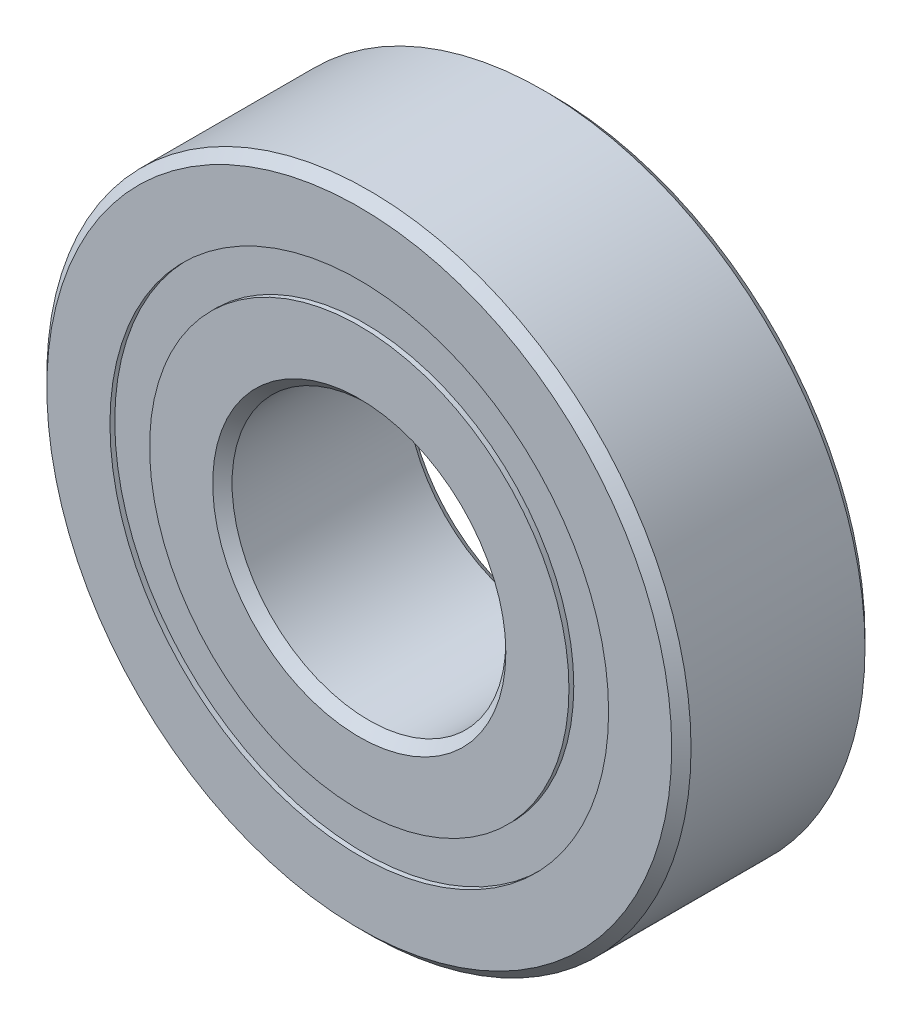
ISO-10303-21;
HEADER;
FILE_DESCRIPTION(('STEP AP214'),'2;1');
FILE_NAME('part.step','',(''),(''),'','','');
FILE_SCHEMA(('AUTOMOTIVE_DESIGN { 1 0 10303 214 1 1 1 1 }'));
ENDSEC;
DATA;
#1=APPLICATION_CONTEXT('core data for automotive mechanical design processes');
#2=APPLICATION_PROTOCOL_DEFINITION('international standard','automotive_design',2000,#1);
#3=PRODUCT_CONTEXT('',#1,'mechanical');
#4=PRODUCT('Part','Part','',(#3));
#5=PRODUCT_RELATED_PRODUCT_CATEGORY('part','',(#4));
#6=PRODUCT_DEFINITION_FORMATION('','',#4);
#7=PRODUCT_DEFINITION_CONTEXT('part definition',#1,'design');
#8=PRODUCT_DEFINITION('design','',#6,#7);
#9=PRODUCT_DEFINITION_SHAPE('','',#8);
#10=(LENGTH_UNIT() NAMED_UNIT(*) SI_UNIT(.MILLI.,.METRE.));
#11=(NAMED_UNIT(*) PLANE_ANGLE_UNIT() SI_UNIT($,.RADIAN.));
#12=(NAMED_UNIT(*) SI_UNIT($,.STERADIAN.) SOLID_ANGLE_UNIT());
#13=UNCERTAINTY_MEASURE_WITH_UNIT(LENGTH_MEASURE(1.E-05),#10,'distance_accuracy_value','');
#14=(GEOMETRIC_REPRESENTATION_CONTEXT(3) GLOBAL_UNCERTAINTY_ASSIGNED_CONTEXT((#13)) GLOBAL_UNIT_ASSIGNED_CONTEXT((#10,
#11,#12)) REPRESENTATION_CONTEXT('',''));
#15=CARTESIAN_POINT('',(0.,0.,0.));
#16=DIRECTION('',(0.,0.,1.));
#17=DIRECTION('',(1.,0.,0.));
#18=AXIS2_PLACEMENT_3D('',#15,#16,#17);
#19=CARTESIAN_POINT('',(0.,15.4807692307692,-5.70000000000001));
#20=DIRECTION('',(0.,0.,1.));
#21=DIRECTION('',(1.,0.,0.));
#22=AXIS2_PLACEMENT_3D('',#19,#20,#21);
#23=PLANE('',#22);
#24=CARTESIAN_POINT('',(0.,0.,-5.70000000000001));
#25=DIRECTION('',(0.,0.,1.));
#26=DIRECTION('',(1.,0.,0.));
#27=AXIS2_PLACEMENT_3D('',#24,#25,#26);
#28=CIRCLE('',#27,15.4807692307692);
#29=CARTESIAN_POINT('',(15.4807692307692,0.,-5.70000000000001));
#30=VERTEX_POINT('',#29);
#31=EDGE_CURVE('E70',#30,#30,#28,.T.);
#32=ORIENTED_EDGE('',*,*,#31,.F.);
#33=EDGE_LOOP('',(#32));
#34=FACE_BOUND('',#33,.T.);
#35=CARTESIAN_POINT('',(0.,0.,-5.70000000000001));
#36=DIRECTION('',(0.,0.,1.));
#37=DIRECTION('',(1.,0.,0.));
#38=AXIS2_PLACEMENT_3D('',#35,#36,#37);
#39=CIRCLE('',#38,13.0192307692308);
#40=CARTESIAN_POINT('',(13.0192307692308,0.,-5.70000000000001));
#41=VERTEX_POINT('',#40);
#42=EDGE_CURVE('E11',#41,#41,#39,.T.);
#43=ORIENTED_EDGE('',*,*,#42,.T.);
#44=EDGE_LOOP('',(#43));
#45=FACE_BOUND('',#44,.T.);
#46=ADVANCED_FACE('F56',(#34,#45),#23,.F.);
#47=CARTESIAN_POINT('',(0.,0.,6.));
#48=DIRECTION('',(0.,0.,1.));
#49=DIRECTION('',(1.,0.,0.));
#50=AXIS2_PLACEMENT_3D('',#47,#48,#49);
#51=CYLINDRICAL_SURFACE('',#50,13.0192307692308);
#52=ORIENTED_EDGE('',*,*,#42,.F.);
#53=EDGE_LOOP('',(#52));
#54=FACE_BOUND('',#53,.T.);
#55=CARTESIAN_POINT('',(0.,0.,-2.93698893605669));
#56=DIRECTION('',(0.,0.,1.));
#57=DIRECTION('',(1.,0.,0.));
#58=AXIS2_PLACEMENT_3D('',#55,#56,#57);
#59=CIRCLE('',#58,13.0192307692308);
#60=CARTESIAN_POINT('',(13.0192307692308,0.,-2.93698893605669));
#61=VERTEX_POINT('',#60);
#62=EDGE_CURVE('E62',#61,#61,#59,.T.);
#63=ORIENTED_EDGE('',*,*,#62,.T.);
#64=EDGE_LOOP('',(#63));
#65=FACE_BOUND('',#64,.T.);
#66=ADVANCED_FACE('F79',(#54,#65),#51,.F.);
#67=CARTESIAN_POINT('',(0.,15.4807692307692,-2.93698893605669));
#68=DIRECTION('',(0.,0.,-1.));
#69=DIRECTION('',(-1.,0.,0.));
#70=AXIS2_PLACEMENT_3D('',#67,#68,#69);
#71=PLANE('',#70);
#72=ORIENTED_EDGE('',*,*,#62,.F.);
#73=EDGE_LOOP('',(#72));
#74=FACE_BOUND('',#73,.T.);
#75=CARTESIAN_POINT('',(0.,0.,-2.93698893605669));
#76=DIRECTION('',(0.,0.,1.));
#77=DIRECTION('',(1.,0.,0.));
#78=AXIS2_PLACEMENT_3D('',#75,#76,#77);
#79=CIRCLE('',#78,15.4807692307692);
#80=CARTESIAN_POINT('',(15.4807692307692,0.,-2.93698893605669));
#81=VERTEX_POINT('',#80);
#82=EDGE_CURVE('E66',#81,#81,#79,.T.);
#83=ORIENTED_EDGE('',*,*,#82,.T.);
#84=EDGE_LOOP('',(#83));
#85=FACE_BOUND('',#84,.T.);
#86=ADVANCED_FACE('F83',(#74,#85),#71,.F.);
#87=CARTESIAN_POINT('',(0.,0.,6.));
#88=DIRECTION('',(0.,0.,1.));
#89=DIRECTION('',(1.,0.,0.));
#90=AXIS2_PLACEMENT_3D('',#87,#88,#89);
#91=CYLINDRICAL_SURFACE('',#90,15.4807692307692);
#92=ORIENTED_EDGE('',*,*,#82,.F.);
#93=EDGE_LOOP('',(#92));
#94=FACE_BOUND('',#93,.T.);
#95=ORIENTED_EDGE('',*,*,#31,.T.);
#96=EDGE_LOOP('',(#95));
#97=FACE_BOUND('',#96,.T.);
#98=ADVANCED_FACE('F76',(#94,#97),#91,.T.);
#99=CLOSED_SHELL('',(#46,#66,#86,#98));
#100=MANIFOLD_SOLID_BREP('B2',#99);
#101=CARTESIAN_POINT('',(0.,15.4807692307692,5.7));
#102=DIRECTION('',(0.,0.,-1.));
#103=DIRECTION('',(-1.,0.,0.));
#104=AXIS2_PLACEMENT_3D('',#101,#102,#103);
#105=PLANE('',#104);
#106=CARTESIAN_POINT('',(0.,0.,5.7));
#107=DIRECTION('',(0.,0.,1.));
#108=DIRECTION('',(1.,0.,0.));
#109=AXIS2_PLACEMENT_3D('',#106,#107,#108);
#110=CIRCLE('',#109,13.0192307692308);
#111=CARTESIAN_POINT('',(13.0192307692308,0.,5.7));
#112=VERTEX_POINT('',#111);
#113=EDGE_CURVE('E55',#112,#112,#110,.T.);
#114=ORIENTED_EDGE('',*,*,#113,.F.);
#115=EDGE_LOOP('',(#114));
#116=FACE_BOUND('',#115,.T.);
#117=CARTESIAN_POINT('',(0.,0.,5.7));
#118=DIRECTION('',(0.,0.,1.));
#119=DIRECTION('',(1.,0.,0.));
#120=AXIS2_PLACEMENT_3D('',#117,#118,#119);
#121=CIRCLE('',#120,15.4807692307692);
#122=CARTESIAN_POINT('',(15.4807692307692,0.,5.7));
#123=VERTEX_POINT('',#122);
#124=EDGE_CURVE('E130',#123,#123,#121,.T.);
#125=ORIENTED_EDGE('',*,*,#124,.T.);
#126=EDGE_LOOP('',(#125));
#127=FACE_BOUND('',#126,.T.);
#128=ADVANCED_FACE('F116',(#116,#127),#105,.F.);
#129=CARTESIAN_POINT('',(0.,0.,6.));
#130=DIRECTION('',(0.,0.,1.));
#131=DIRECTION('',(1.,0.,0.));
#132=AXIS2_PLACEMENT_3D('',#129,#130,#131);
#133=CYLINDRICAL_SURFACE('',#132,13.0192307692308);
#134=CARTESIAN_POINT('',(0.,0.,2.93698893605668));
#135=DIRECTION('',(0.,0.,1.));
#136=DIRECTION('',(1.,0.,0.));
#137=AXIS2_PLACEMENT_3D('',#134,#135,#136);
#138=CIRCLE('',#137,13.0192307692308);
#139=CARTESIAN_POINT('',(13.0192307692308,0.,2.93698893605668));
#140=VERTEX_POINT('',#139);
#141=EDGE_CURVE('E122',#140,#140,#138,.T.);
#142=ORIENTED_EDGE('',*,*,#141,.F.);
#143=EDGE_LOOP('',(#142));
#144=FACE_BOUND('',#143,.T.);
#145=ORIENTED_EDGE('',*,*,#113,.T.);
#146=EDGE_LOOP('',(#145));
#147=FACE_BOUND('',#146,.T.);
#148=ADVANCED_FACE('F145',(#144,#147),#133,.F.);
#149=CARTESIAN_POINT('',(0.,15.4807692307692,2.93698893605668));
#150=DIRECTION('',(0.,0.,1.));
#151=DIRECTION('',(1.,0.,0.));
#152=AXIS2_PLACEMENT_3D('',#149,#150,#151);
#153=PLANE('',#152);
#154=CARTESIAN_POINT('',(0.,0.,2.93698893605668));
#155=DIRECTION('',(0.,0.,1.));
#156=DIRECTION('',(1.,0.,0.));
#157=AXIS2_PLACEMENT_3D('',#154,#155,#156);
#158=CIRCLE('',#157,15.4807692307692);
#159=CARTESIAN_POINT('',(15.4807692307692,0.,2.93698893605668));
#160=VERTEX_POINT('',#159);
#161=EDGE_CURVE('E126',#160,#160,#158,.T.);
#162=ORIENTED_EDGE('',*,*,#161,.F.);
#163=EDGE_LOOP('',(#162));
#164=FACE_BOUND('',#163,.T.);
#165=ORIENTED_EDGE('',*,*,#141,.T.);
#166=EDGE_LOOP('',(#165));
#167=FACE_BOUND('',#166,.T.);
#168=ADVANCED_FACE('F140',(#164,#167),#153,.F.);
#169=CARTESIAN_POINT('',(0.,0.,6.));
#170=DIRECTION('',(0.,0.,1.));
#171=DIRECTION('',(1.,0.,0.));
#172=AXIS2_PLACEMENT_3D('',#169,#170,#171);
#173=CYLINDRICAL_SURFACE('',#172,15.4807692307692);
#174=ORIENTED_EDGE('',*,*,#124,.F.);
#175=EDGE_LOOP('',(#174));
#176=FACE_BOUND('',#175,.T.);
#177=ORIENTED_EDGE('',*,*,#161,.T.);
#178=EDGE_LOOP('',(#177));
#179=FACE_BOUND('',#178,.T.);
#180=ADVANCED_FACE('F137',(#176,#179),#173,.T.);
#181=CLOSED_SHELL('',(#128,#148,#168,#180));
#182=MANIFOLD_SOLID_BREP('B6',#181);
#183=CARTESIAN_POINT('',(-6.18284328242503,12.8388063676096,0.));
#184=DIRECTION('',(0.,0.,1.));
#185=DIRECTION('',(-0.433883739117546,0.900968867902425,0.));
#186=AXIS2_PLACEMENT_3D('',#183,#184,#185);
#187=SPHERICAL_SURFACE('',#186,2.93698893605669);
#188=CARTESIAN_POINT('',(-6.18284328242503,12.8388063676096,2.93698893605668));
#189=VERTEX_POINT('',#188);
#190=VERTEX_LOOP('',#189);
#191=FACE_BOUND('',#190,.T.);
#192=ADVANCED_FACE('F176',(#191),#187,.T.);
#193=CLOSED_SHELL('',(#192));
#194=MANIFOLD_SOLID_BREP('B50',#193);
#195=CARTESIAN_POINT('',(-11.1410986251693,8.88472967648709,0.));
#196=DIRECTION('',(0.,0.,1.));
#197=DIRECTION('',(-0.781831482468022,0.623489801858743,0.));
#198=AXIS2_PLACEMENT_3D('',#195,#196,#197);
#199=SPHERICAL_SURFACE('',#198,2.93698893605669);
#200=CARTESIAN_POINT('',(-11.1410986251693,8.88472967648709,2.93698893605668));
#201=VERTEX_POINT('',#200);
#202=VERTEX_LOOP('',#201);
#203=FACE_BOUND('',#202,.T.);
#204=ADVANCED_FACE('F199',(#203),#199,.T.);
#205=CLOSED_SHELL('',(#204));
#206=MANIFOLD_SOLID_BREP('B112',#205);
#207=CARTESIAN_POINT('',(-13.892722748591,3.17092330887763,0.));
#208=DIRECTION('',(0.,0.,1.));
#209=DIRECTION('',(-0.974927912181821,0.222520933956325,0.));
#210=AXIS2_PLACEMENT_3D('',#207,#208,#209);
#211=SPHERICAL_SURFACE('',#210,2.93698893605669);
#212=CARTESIAN_POINT('',(-13.892722748591,3.17092330887763,2.93698893605668));
#213=VERTEX_POINT('',#212);
#214=VERTEX_LOOP('',#213);
#215=FACE_BOUND('',#214,.T.);
#216=ADVANCED_FACE('F222',(#215),#211,.T.);
#217=CLOSED_SHELL('',(#216));
#218=MANIFOLD_SOLID_BREP('B172',#217);
#219=CARTESIAN_POINT('',(-13.892722748591,-3.17092330887735,0.));
#220=DIRECTION('',(0.,0.,1.));
#221=DIRECTION('',(-0.974927912181826,-0.222520933956305,0.));
#222=AXIS2_PLACEMENT_3D('',#219,#220,#221);
#223=SPHERICAL_SURFACE('',#222,2.93698893605669);
#224=CARTESIAN_POINT('',(-13.892722748591,-3.17092330887735,2.93698893605668));
#225=VERTEX_POINT('',#224);
#226=VERTEX_LOOP('',#225);
#227=FACE_BOUND('',#226,.T.);
#228=ADVANCED_FACE('F245',(#227),#223,.T.);
#229=CLOSED_SHELL('',(#228));
#230=MANIFOLD_SOLID_BREP('B195',#229);
#231=CARTESIAN_POINT('',(-11.1410986251695,-8.88472967648686,0.));
#232=DIRECTION('',(0.,0.,1.));
#233=DIRECTION('',(-0.781831482468035,-0.623489801858727,0.));
#234=AXIS2_PLACEMENT_3D('',#231,#232,#233);
#235=SPHERICAL_SURFACE('',#234,2.93698893605669);
#236=CARTESIAN_POINT('',(-11.1410986251695,-8.88472967648686,2.93698893605668));
#237=VERTEX_POINT('',#236);
#238=VERTEX_LOOP('',#237);
#239=FACE_BOUND('',#238,.T.);
#240=ADVANCED_FACE('F268',(#239),#235,.T.);
#241=CLOSED_SHELL('',(#240));
#242=MANIFOLD_SOLID_BREP('B218',#241);
#243=CARTESIAN_POINT('',(-6.1828432824253,-12.8388063676094,0.));
#244=DIRECTION('',(0.,0.,1.));
#245=DIRECTION('',(-0.433883739117565,-0.900968867902416,0.));
#246=AXIS2_PLACEMENT_3D('',#243,#244,#245);
#247=SPHERICAL_SURFACE('',#246,2.93698893605669);
#248=CARTESIAN_POINT('',(-6.1828432824253,-12.8388063676094,2.93698893605668));
#249=VERTEX_POINT('',#248);
#250=VERTEX_LOOP('',#249);
#251=FACE_BOUND('',#250,.T.);
#252=ADVANCED_FACE('F291',(#251),#247,.T.);
#253=CLOSED_SHELL('',(#252));
#254=MANIFOLD_SOLID_BREP('B241',#253);
#255=CARTESIAN_POINT('',(0.,-14.25,0.));
#256=DIRECTION('',(0.,0.,1.));
#257=DIRECTION('',(0.,-1.,0.));
#258=AXIS2_PLACEMENT_3D('',#255,#256,#257);
#259=SPHERICAL_SURFACE('',#258,2.93698893605669);
#260=CARTESIAN_POINT('',(0.,-14.25,2.93698893605668));
#261=VERTEX_POINT('',#260);
#262=VERTEX_LOOP('',#261);
#263=FACE_BOUND('',#262,.T.);
#264=ADVANCED_FACE('F314',(#263),#259,.T.);
#265=CLOSED_SHELL('',(#264));
#266=MANIFOLD_SOLID_BREP('B264',#265);
#267=CARTESIAN_POINT('',(6.18284328242512,-12.8388063676095,0.));
#268=DIRECTION('',(0.,0.,1.));
#269=DIRECTION('',(0.433883739117553,-0.900968867902422,0.));
#270=AXIS2_PLACEMENT_3D('',#267,#268,#269);
#271=SPHERICAL_SURFACE('',#270,2.93698893605669);
#272=CARTESIAN_POINT('',(6.18284328242512,-12.8388063676095,2.93698893605668));
#273=VERTEX_POINT('',#272);
#274=VERTEX_LOOP('',#273);
#275=FACE_BOUND('',#274,.T.);
#276=ADVANCED_FACE('F337',(#275),#271,.T.);
#277=CLOSED_SHELL('',(#276));
#278=MANIFOLD_SOLID_BREP('B287',#277);
#279=CARTESIAN_POINT('',(11.1410986251694,-8.88472967648701,0.));
#280=DIRECTION('',(0.,0.,1.));
#281=DIRECTION('',(0.781831482468027,-0.623489801858737,0.));
#282=AXIS2_PLACEMENT_3D('',#279,#280,#281);
#283=SPHERICAL_SURFACE('',#282,2.93698893605669);
#284=CARTESIAN_POINT('',(11.1410986251694,-8.88472967648701,2.93698893605668));
#285=VERTEX_POINT('',#284);
#286=VERTEX_LOOP('',#285);
#287=FACE_BOUND('',#286,.T.);
#288=ADVANCED_FACE('F360',(#287),#283,.T.);
#289=CLOSED_SHELL('',(#288));
#290=MANIFOLD_SOLID_BREP('B310',#289);
#291=CARTESIAN_POINT('',(13.892722748591,-3.17092330887753,0.));
#292=DIRECTION('',(0.,0.,1.));
#293=DIRECTION('',(0.974927912181823,-0.222520933956318,0.));
#294=AXIS2_PLACEMENT_3D('',#291,#292,#293);
#295=SPHERICAL_SURFACE('',#294,2.93698893605669);
#296=CARTESIAN_POINT('',(13.892722748591,-3.17092330887753,2.93698893605668));
#297=VERTEX_POINT('',#296);
#298=VERTEX_LOOP('',#297);
#299=FACE_BOUND('',#298,.T.);
#300=ADVANCED_FACE('F383',(#299),#295,.T.);
#301=CLOSED_SHELL('',(#300));
#302=MANIFOLD_SOLID_BREP('B333',#301);
#303=CARTESIAN_POINT('',(13.892722748591,3.17092330887744,0.));
#304=DIRECTION('',(0.,0.,1.));
#305=DIRECTION('',(0.974927912181824,0.222520933956311,0.));
#306=AXIS2_PLACEMENT_3D('',#303,#304,#305);
#307=SPHERICAL_SURFACE('',#306,2.93698893605669);
#308=CARTESIAN_POINT('',(13.892722748591,3.17092330887744,2.93698893605668));
#309=VERTEX_POINT('',#308);
#310=VERTEX_LOOP('',#309);
#311=FACE_BOUND('',#310,.T.);
#312=ADVANCED_FACE('F406',(#311),#307,.T.);
#313=CLOSED_SHELL('',(#312));
#314=MANIFOLD_SOLID_BREP('B356',#313);
#315=CARTESIAN_POINT('',(11.1410986251694,8.88472967648693,0.));
#316=DIRECTION('',(0.,0.,1.));
#317=DIRECTION('',(0.781831482468031,0.623489801858732,0.));
#318=AXIS2_PLACEMENT_3D('',#315,#316,#317);
#319=SPHERICAL_SURFACE('',#318,2.93698893605669);
#320=CARTESIAN_POINT('',(11.1410986251694,8.88472967648693,2.93698893605668));
#321=VERTEX_POINT('',#320);
#322=VERTEX_LOOP('',#321);
#323=FACE_BOUND('',#322,.T.);
#324=ADVANCED_FACE('F429',(#323),#319,.T.);
#325=CLOSED_SHELL('',(#324));
#326=MANIFOLD_SOLID_BREP('B379',#325);
#327=CARTESIAN_POINT('',(6.18284328242522,12.8388063676095,0.));
#328=DIRECTION('',(0.,0.,1.));
#329=DIRECTION('',(0.433883739117559,0.900968867902419,0.));
#330=AXIS2_PLACEMENT_3D('',#327,#328,#329);
#331=SPHERICAL_SURFACE('',#330,2.93698893605669);
#332=CARTESIAN_POINT('',(6.18284328242522,12.8388063676095,2.93698893605668));
#333=VERTEX_POINT('',#332);
#334=VERTEX_LOOP('',#333);
#335=FACE_BOUND('',#334,.T.);
#336=ADVANCED_FACE('F452',(#335),#331,.T.);
#337=CLOSED_SHELL('',(#336));
#338=MANIFOLD_SOLID_BREP('B402',#337);
#339=CARTESIAN_POINT('',(0.,14.25,0.));
#340=DIRECTION('',(0.,0.,1.));
#341=DIRECTION('',(0.,1.,0.));
#342=AXIS2_PLACEMENT_3D('',#339,#340,#341);
#343=SPHERICAL_SURFACE('',#342,2.93698893605669);
#344=CARTESIAN_POINT('',(0.,14.25,2.93698893605668));
#345=VERTEX_POINT('',#344);
#346=VERTEX_LOOP('',#345);
#347=FACE_BOUND('',#346,.T.);
#348=ADVANCED_FACE('F477',(#347),#343,.T.);
#349=CLOSED_SHELL('',(#348));
#350=MANIFOLD_SOLID_BREP('B425',#349);
#351=CARTESIAN_POINT('',(0.,13.0192307692308,6.00000000000001));
#352=DIRECTION('',(0.,0.,-1.));
#353=DIRECTION('',(-1.,0.,0.));
#354=AXIS2_PLACEMENT_3D('',#351,#352,#353);
#355=PLANE('',#354);
#356=CARTESIAN_POINT('',(0.,0.,6.));
#357=DIRECTION('',(0.,0.,1.));
#358=DIRECTION('',(1.,0.,0.));
#359=AXIS2_PLACEMENT_3D('',#356,#357,#358);
#360=CIRCLE('',#359,9.1);
#361=CARTESIAN_POINT('',(9.1,0.,6.));
#362=VERTEX_POINT('',#361);
#363=EDGE_CURVE('E523',#362,#362,#360,.T.);
#364=ORIENTED_EDGE('',*,*,#363,.F.);
#365=EDGE_LOOP('',(#364));
#366=FACE_BOUND('',#365,.T.);
#367=CARTESIAN_POINT('',(0.,0.,6.00000000000001));
#368=DIRECTION('',(0.,0.,1.));
#369=DIRECTION('',(1.,0.,0.));
#370=AXIS2_PLACEMENT_3D('',#367,#368,#369);
#371=CIRCLE('',#370,13.0192307692308);
#372=CARTESIAN_POINT('',(13.0192307692308,0.,6.00000000000001));
#373=VERTEX_POINT('',#372);
#374=EDGE_CURVE('E476',#373,#373,#371,.T.);
#375=ORIENTED_EDGE('',*,*,#374,.T.);
#376=EDGE_LOOP('',(#375));
#377=FACE_BOUND('',#376,.T.);
#378=ADVANCED_FACE('F495',(#366,#377),#355,.F.);
#379=CARTESIAN_POINT('',(0.,0.,6.));
#380=DIRECTION('',(0.,0.,1.));
#381=DIRECTION('',(1.,0.,0.));
#382=AXIS2_PLACEMENT_3D('',#379,#380,#381);
#383=CYLINDRICAL_SURFACE('',#382,13.0192307692308);
#384=ORIENTED_EDGE('',*,*,#374,.F.);
#385=EDGE_LOOP('',(#384));
#386=FACE_BOUND('',#385,.T.);
#387=CARTESIAN_POINT('',(0.,0.,2.66666666666666));
#388=DIRECTION('',(0.,0.,1.));
#389=DIRECTION('',(1.,0.,0.));
#390=AXIS2_PLACEMENT_3D('',#387,#388,#389);
#391=CIRCLE('',#390,13.0192307692308);
#392=CARTESIAN_POINT('',(13.0192307692308,0.,2.66666666666666));
#393=VERTEX_POINT('',#392);
#394=EDGE_CURVE('E501',#393,#393,#391,.T.);
#395=ORIENTED_EDGE('',*,*,#394,.T.);
#396=EDGE_LOOP('',(#395));
#397=FACE_BOUND('',#396,.T.);
#398=ADVANCED_FACE('F530',(#386,#397),#383,.T.);
#399=CARTESIAN_POINT('',(0.,0.,0.));
#400=DIRECTION('',(0.,0.,1.));
#401=DIRECTION('',(1.,0.,0.));
#402=AXIS2_PLACEMENT_3D('',#399,#400,#401);
#403=TOROIDAL_SURFACE('',#402,14.25,2.93698893605668);
#404=ORIENTED_EDGE('',*,*,#394,.F.);
#405=EDGE_LOOP('',(#404));
#406=FACE_BOUND('',#405,.T.);
#407=CARTESIAN_POINT('',(0.,0.,-2.66666666666667));
#408=DIRECTION('',(0.,0.,1.));
#409=DIRECTION('',(1.,0.,0.));
#410=AXIS2_PLACEMENT_3D('',#407,#408,#409);
#411=CIRCLE('',#410,13.0192307692308);
#412=CARTESIAN_POINT('',(13.0192307692308,0.,-2.66666666666667));
#413=VERTEX_POINT('',#412);
#414=EDGE_CURVE('E505',#413,#413,#411,.T.);
#415=ORIENTED_EDGE('',*,*,#414,.T.);
#416=EDGE_LOOP('',(#415));
#417=FACE_BOUND('',#416,.T.);
#418=ADVANCED_FACE('F534',(#406,#417),#403,.F.);
#419=CARTESIAN_POINT('',(0.,0.,6.));
#420=DIRECTION('',(0.,0.,1.));
#421=DIRECTION('',(1.,0.,0.));
#422=AXIS2_PLACEMENT_3D('',#419,#420,#421);
#423=CYLINDRICAL_SURFACE('',#422,13.0192307692308);
#424=ORIENTED_EDGE('',*,*,#414,.F.);
#425=EDGE_LOOP('',(#424));
#426=FACE_BOUND('',#425,.T.);
#427=CARTESIAN_POINT('',(0.,0.,-6.00000000000001));
#428=DIRECTION('',(0.,0.,1.));
#429=DIRECTION('',(1.,0.,0.));
#430=AXIS2_PLACEMENT_3D('',#427,#428,#429);
#431=CIRCLE('',#430,13.0192307692308);
#432=CARTESIAN_POINT('',(13.0192307692308,0.,-6.00000000000001));
#433=VERTEX_POINT('',#432);
#434=EDGE_CURVE('E509',#433,#433,#431,.T.);
#435=ORIENTED_EDGE('',*,*,#434,.T.);
#436=EDGE_LOOP('',(#435));
#437=FACE_BOUND('',#436,.T.);
#438=ADVANCED_FACE('F539',(#426,#437),#423,.T.);
#439=CARTESIAN_POINT('',(0.,9.1,-6.00000000000001));
#440=DIRECTION('',(0.,0.,1.));
#441=DIRECTION('',(1.,0.,0.));
#442=AXIS2_PLACEMENT_3D('',#439,#440,#441);
#443=PLANE('',#442);
#444=ORIENTED_EDGE('',*,*,#434,.F.);
#445=EDGE_LOOP('',(#444));
#446=FACE_BOUND('',#445,.T.);
#447=CARTESIAN_POINT('',(0.,0.,-6.00000000000001));
#448=DIRECTION('',(0.,0.,1.));
#449=DIRECTION('',(1.,0.,0.));
#450=AXIS2_PLACEMENT_3D('',#447,#448,#449);
#451=CIRCLE('',#450,9.1);
#452=CARTESIAN_POINT('',(9.1,0.,-6.00000000000001));
#453=VERTEX_POINT('',#452);
#454=EDGE_CURVE('E514',#453,#453,#451,.T.);
#455=ORIENTED_EDGE('',*,*,#454,.T.);
#456=EDGE_LOOP('',(#455));
#457=FACE_BOUND('',#456,.T.);
#458=ADVANCED_FACE('F545',(#446,#457),#443,.F.);
#459=CARTESIAN_POINT('',(0.,0.,-5.40000000000001));
#460=DIRECTION('',(0.,0.,-1.));
#461=DIRECTION('',(-1.,0.,0.));
#462=AXIS2_PLACEMENT_3D('',#459,#460,#461);
#463=CONICAL_SURFACE('',#462,8.5,0.785398163397444);
#464=ORIENTED_EDGE('',*,*,#454,.F.);
#465=EDGE_LOOP('',(#464));
#466=FACE_BOUND('',#465,.T.);
#467=CARTESIAN_POINT('',(0.,0.,-5.40000000000001));
#468=DIRECTION('',(0.,0.,1.));
#469=DIRECTION('',(1.,0.,0.));
#470=AXIS2_PLACEMENT_3D('',#467,#468,#469);
#471=CIRCLE('',#470,8.5);
#472=CARTESIAN_POINT('',(8.5,0.,-5.40000000000001));
#473=VERTEX_POINT('',#472);
#474=EDGE_CURVE('E517',#473,#473,#471,.T.);
#475=ORIENTED_EDGE('',*,*,#474,.T.);
#476=EDGE_LOOP('',(#475));
#477=FACE_BOUND('',#476,.T.);
#478=ADVANCED_FACE('F549',(#466,#477),#463,.F.);
#479=CARTESIAN_POINT('',(0.,0.,6.));
#480=DIRECTION('',(0.,0.,1.));
#481=DIRECTION('',(1.,0.,0.));
#482=AXIS2_PLACEMENT_3D('',#479,#480,#481);
#483=CYLINDRICAL_SURFACE('',#482,8.5);
#484=ORIENTED_EDGE('',*,*,#474,.F.);
#485=EDGE_LOOP('',(#484));
#486=FACE_BOUND('',#485,.T.);
#487=CARTESIAN_POINT('',(0.,0.,5.4));
#488=DIRECTION('',(0.,0.,1.));
#489=DIRECTION('',(1.,0.,0.));
#490=AXIS2_PLACEMENT_3D('',#487,#488,#489);
#491=CIRCLE('',#490,8.5);
#492=CARTESIAN_POINT('',(8.5,0.,5.4));
#493=VERTEX_POINT('',#492);
#494=EDGE_CURVE('E520',#493,#493,#491,.T.);
#495=ORIENTED_EDGE('',*,*,#494,.T.);
#496=EDGE_LOOP('',(#495));
#497=FACE_BOUND('',#496,.T.);
#498=ADVANCED_FACE('F553',(#486,#497),#483,.F.);
#499=CARTESIAN_POINT('',(0.,0.,6.));
#500=DIRECTION('',(0.,0.,1.));
#501=DIRECTION('',(1.,0.,0.));
#502=AXIS2_PLACEMENT_3D('',#499,#500,#501);
#503=CONICAL_SURFACE('',#502,9.1,0.785398163397453);
#504=ORIENTED_EDGE('',*,*,#494,.F.);
#505=EDGE_LOOP('',(#504));
#506=FACE_BOUND('',#505,.T.);
#507=ORIENTED_EDGE('',*,*,#363,.T.);
#508=EDGE_LOOP('',(#507));
#509=FACE_BOUND('',#508,.T.);
#510=ADVANCED_FACE('F527',(#506,#509),#503,.F.);
#511=CLOSED_SHELL('',(#378,#398,#418,#438,#458,#478,#498,#510));
#512=MANIFOLD_SOLID_BREP('B448',#511);
#513=CARTESIAN_POINT('',(0.,0.,5.4));
#514=DIRECTION('',(0.,0.,-1.));
#515=DIRECTION('',(-1.,0.,0.));
#516=AXIS2_PLACEMENT_3D('',#513,#514,#515);
#517=CONICAL_SURFACE('',#516,20.,0.785398163397448);
#518=CARTESIAN_POINT('',(0.,0.,6.));
#519=DIRECTION('',(0.,0.,1.));
#520=DIRECTION('',(1.,0.,0.));
#521=AXIS2_PLACEMENT_3D('',#518,#519,#520);
#522=CIRCLE('',#521,19.4);
#523=CARTESIAN_POINT('',(19.4,0.,6.));
#524=VERTEX_POINT('',#523);
#525=EDGE_CURVE('E636',#524,#524,#522,.T.);
#526=ORIENTED_EDGE('',*,*,#525,.F.);
#527=EDGE_LOOP('',(#526));
#528=FACE_BOUND('',#527,.T.);
#529=CARTESIAN_POINT('',(0.,0.,5.4));
#530=DIRECTION('',(0.,0.,1.));
#531=DIRECTION('',(1.,0.,0.));
#532=AXIS2_PLACEMENT_3D('',#529,#530,#531);
#533=CIRCLE('',#532,20.);
#534=CARTESIAN_POINT('',(20.,0.,5.4));
#535=VERTEX_POINT('',#534);
#536=EDGE_CURVE('E494',#535,#535,#533,.T.);
#537=ORIENTED_EDGE('',*,*,#536,.T.);
#538=EDGE_LOOP('',(#537));
#539=FACE_BOUND('',#538,.T.);
#540=ADVANCED_FACE('F601',(#528,#539),#517,.T.);
#541=CARTESIAN_POINT('',(0.,0.,6.));
#542=DIRECTION('',(0.,0.,1.));
#543=DIRECTION('',(1.,0.,0.));
#544=AXIS2_PLACEMENT_3D('',#541,#542,#543);
#545=CYLINDRICAL_SURFACE('',#544,20.);
#546=ORIENTED_EDGE('',*,*,#536,.F.);
#547=EDGE_LOOP('',(#546));
#548=FACE_BOUND('',#547,.T.);
#549=CARTESIAN_POINT('',(0.,0.,-5.40000000000001));
#550=DIRECTION('',(0.,0.,1.));
#551=DIRECTION('',(1.,0.,0.));
#552=AXIS2_PLACEMENT_3D('',#549,#550,#551);
#553=CIRCLE('',#552,20.);
#554=CARTESIAN_POINT('',(20.,0.,-5.40000000000001));
#555=VERTEX_POINT('',#554);
#556=EDGE_CURVE('E608',#555,#555,#553,.T.);
#557=ORIENTED_EDGE('',*,*,#556,.T.);
#558=EDGE_LOOP('',(#557));
#559=FACE_BOUND('',#558,.T.);
#560=ADVANCED_FACE('F644',(#548,#559),#545,.T.);
#561=CARTESIAN_POINT('',(0.,0.,-6.00000000000001));
#562=DIRECTION('',(0.,0.,1.));
#563=DIRECTION('',(1.,0.,0.));
#564=AXIS2_PLACEMENT_3D('',#561,#562,#563);
#565=CONICAL_SURFACE('',#564,19.4,0.785398163397448);
#566=ORIENTED_EDGE('',*,*,#556,.F.);
#567=EDGE_LOOP('',(#566));
#568=FACE_BOUND('',#567,.T.);
#569=CARTESIAN_POINT('',(0.,0.,-6.00000000000001));
#570=DIRECTION('',(0.,0.,1.));
#571=DIRECTION('',(1.,0.,0.));
#572=AXIS2_PLACEMENT_3D('',#569,#570,#571);
#573=CIRCLE('',#572,19.4);
#574=CARTESIAN_POINT('',(19.4,0.,-6.00000000000001));
#575=VERTEX_POINT('',#574);
#576=EDGE_CURVE('E613',#575,#575,#573,.T.);
#577=ORIENTED_EDGE('',*,*,#576,.T.);
#578=EDGE_LOOP('',(#577));
#579=FACE_BOUND('',#578,.T.);
#580=ADVANCED_FACE('F648',(#568,#579),#565,.T.);
#581=CARTESIAN_POINT('',(0.,19.4,-6.00000000000001));
#582=DIRECTION('',(0.,0.,1.));
#583=DIRECTION('',(1.,0.,0.));
#584=AXIS2_PLACEMENT_3D('',#581,#582,#583);
#585=PLANE('',#584);
#586=ORIENTED_EDGE('',*,*,#576,.F.);
#587=EDGE_LOOP('',(#586));
#588=FACE_BOUND('',#587,.T.);
#589=CARTESIAN_POINT('',(0.,0.,-6.00000000000001));
#590=DIRECTION('',(0.,0.,1.));
#591=DIRECTION('',(1.,0.,0.));
#592=AXIS2_PLACEMENT_3D('',#589,#590,#591);
#593=CIRCLE('',#592,15.4807692307692);
#594=CARTESIAN_POINT('',(15.4807692307692,0.,-6.00000000000001));
#595=VERTEX_POINT('',#594);
#596=EDGE_CURVE('E618',#595,#595,#593,.T.);
#597=ORIENTED_EDGE('',*,*,#596,.T.);
#598=EDGE_LOOP('',(#597));
#599=FACE_BOUND('',#598,.T.);
#600=ADVANCED_FACE('F653',(#588,#599),#585,.F.);
#601=CARTESIAN_POINT('',(0.,0.,6.));
#602=DIRECTION('',(0.,0.,1.));
#603=DIRECTION('',(1.,0.,0.));
#604=AXIS2_PLACEMENT_3D('',#601,#602,#603);
#605=CYLINDRICAL_SURFACE('',#604,15.4807692307692);
#606=ORIENTED_EDGE('',*,*,#596,.F.);
#607=EDGE_LOOP('',(#606));
#608=FACE_BOUND('',#607,.T.);
#609=CARTESIAN_POINT('',(0.,0.,-2.66666666666667));
#610=DIRECTION('',(0.,0.,1.));
#611=DIRECTION('',(1.,0.,0.));
#612=AXIS2_PLACEMENT_3D('',#609,#610,#611);
#613=CIRCLE('',#612,15.4807692307692);
#614=CARTESIAN_POINT('',(15.4807692307692,0.,-2.66666666666667));
#615=VERTEX_POINT('',#614);
#616=EDGE_CURVE('E624',#615,#615,#613,.T.);
#617=ORIENTED_EDGE('',*,*,#616,.T.);
#618=EDGE_LOOP('',(#617));
#619=FACE_BOUND('',#618,.T.);
#620=ADVANCED_FACE('F659',(#608,#619),#605,.F.);
#621=CARTESIAN_POINT('',(0.,0.,0.));
#622=DIRECTION('',(0.,0.,1.));
#623=DIRECTION('',(1.,0.,0.));
#624=AXIS2_PLACEMENT_3D('',#621,#622,#623);
#625=TOROIDAL_SURFACE('',#624,14.25,2.93698893605669);
#626=ORIENTED_EDGE('',*,*,#616,.F.);
#627=EDGE_LOOP('',(#626));
#628=FACE_BOUND('',#627,.T.);
#629=CARTESIAN_POINT('',(0.,0.,2.66666666666666));
#630=DIRECTION('',(0.,0.,1.));
#631=DIRECTION('',(1.,0.,0.));
#632=AXIS2_PLACEMENT_3D('',#629,#630,#631);
#633=CIRCLE('',#632,15.4807692307692);
#634=CARTESIAN_POINT('',(15.4807692307692,0.,2.66666666666666));
#635=VERTEX_POINT('',#634);
#636=EDGE_CURVE('E628',#635,#635,#633,.T.);
#637=ORIENTED_EDGE('',*,*,#636,.T.);
#638=EDGE_LOOP('',(#637));
#639=FACE_BOUND('',#638,.T.);
#640=ADVANCED_FACE('F663',(#628,#639),#625,.F.);
#641=CARTESIAN_POINT('',(0.,0.,6.));
#642=DIRECTION('',(0.,0.,1.));
#643=DIRECTION('',(1.,0.,0.));
#644=AXIS2_PLACEMENT_3D('',#641,#642,#643);
#645=CYLINDRICAL_SURFACE('',#644,15.4807692307692);
#646=ORIENTED_EDGE('',*,*,#636,.F.);
#647=EDGE_LOOP('',(#646));
#648=FACE_BOUND('',#647,.T.);
#649=CARTESIAN_POINT('',(0.,0.,6.));
#650=DIRECTION('',(0.,0.,1.));
#651=DIRECTION('',(1.,0.,0.));
#652=AXIS2_PLACEMENT_3D('',#649,#650,#651);
#653=CIRCLE('',#652,15.4807692307692);
#654=CARTESIAN_POINT('',(15.4807692307692,0.,6.));
#655=VERTEX_POINT('',#654);
#656=EDGE_CURVE('E632',#655,#655,#653,.T.);
#657=ORIENTED_EDGE('',*,*,#656,.T.);
#658=EDGE_LOOP('',(#657));
#659=FACE_BOUND('',#658,.T.);
#660=ADVANCED_FACE('F667',(#648,#659),#645,.F.);
#661=CARTESIAN_POINT('',(0.,19.4,6.));
#662=DIRECTION('',(0.,0.,-1.));
#663=DIRECTION('',(-1.,0.,0.));
#664=AXIS2_PLACEMENT_3D('',#661,#662,#663);
#665=PLANE('',#664);
#666=ORIENTED_EDGE('',*,*,#656,.F.);
#667=EDGE_LOOP('',(#666));
#668=FACE_BOUND('',#667,.T.);
#669=ORIENTED_EDGE('',*,*,#525,.T.);
#670=EDGE_LOOP('',(#669));
#671=FACE_BOUND('',#670,.T.);
#672=ADVANCED_FACE('F641',(#668,#671),#665,.F.);
#673=CLOSED_SHELL('',(#540,#560,#580,#600,#620,#640,#660,#672));
#674=MANIFOLD_SOLID_BREP('B471',#673);
#675=ADVANCED_BREP_SHAPE_REPRESENTATION('',(#18,#100,#182,#194,#206,#218,#230,#242,#254,#266,
#278,#290,#302,#314,#326,#338,#350,#512,#674),#14);
#676=SHAPE_DEFINITION_REPRESENTATION(#9,#675);
ENDSEC;
END-ISO-10303-21;
